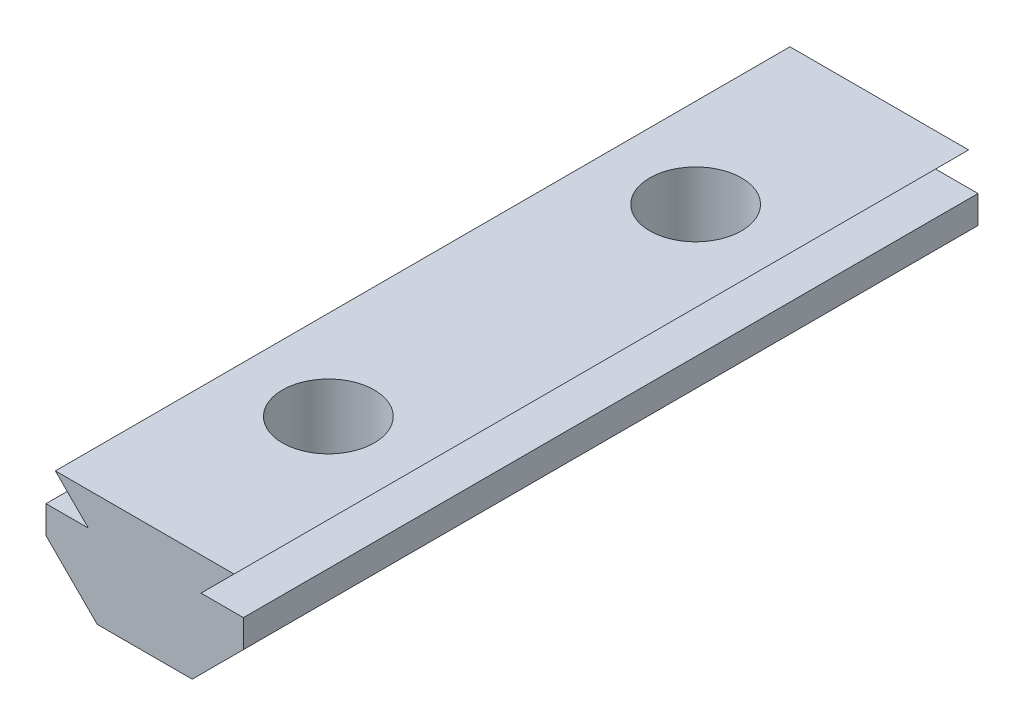
ISO-10303-21;
HEADER;
FILE_DESCRIPTION(('STEP AP214'),'2;1');
FILE_NAME('part.step','',(''),(''),'','','');
FILE_SCHEMA(('AUTOMOTIVE_DESIGN { 1 0 10303 214 1 1 1 1 }'));
ENDSEC;
DATA;
#1=APPLICATION_CONTEXT('core data for automotive mechanical design processes');
#2=APPLICATION_PROTOCOL_DEFINITION('international standard','automotive_design',2000,#1);
#3=PRODUCT_CONTEXT('',#1,'mechanical');
#4=PRODUCT('Part','Part','',(#3));
#5=PRODUCT_RELATED_PRODUCT_CATEGORY('part','',(#4));
#6=PRODUCT_DEFINITION_FORMATION('','',#4);
#7=PRODUCT_DEFINITION_CONTEXT('part definition',#1,'design');
#8=PRODUCT_DEFINITION('design','',#6,#7);
#9=PRODUCT_DEFINITION_SHAPE('','',#8);
#10=(LENGTH_UNIT() NAMED_UNIT(*) SI_UNIT(.MILLI.,.METRE.));
#11=(NAMED_UNIT(*) PLANE_ANGLE_UNIT() SI_UNIT($,.RADIAN.));
#12=(NAMED_UNIT(*) SI_UNIT($,.STERADIAN.) SOLID_ANGLE_UNIT());
#13=UNCERTAINTY_MEASURE_WITH_UNIT(LENGTH_MEASURE(1.E-05),#10,'distance_accuracy_value','');
#14=(GEOMETRIC_REPRESENTATION_CONTEXT(3) GLOBAL_UNCERTAINTY_ASSIGNED_CONTEXT((#13)) GLOBAL_UNIT_ASSIGNED_CONTEXT((#10,
#11,#12)) REPRESENTATION_CONTEXT('',''));
#15=CARTESIAN_POINT('',(0.,0.,0.));
#16=DIRECTION('',(0.,0.,1.));
#17=DIRECTION('',(1.,0.,0.));
#18=AXIS2_PLACEMENT_3D('',#15,#16,#17);
#19=CARTESIAN_POINT('',(2.58565352773282,0.,40.));
#20=DIRECTION('',(-0.707106781186543,0.707106781186552,0.));
#21=DIRECTION('',(-0.707106781186552,-0.707106781186543,0.));
#22=AXIS2_PLACEMENT_3D('',#19,#20,#21);
#23=PLANE('',#22);
#24=DIRECTION('',(0.707106781186552,0.707106781186543,0.));
#25=VECTOR('',#24,1.);
#26=CARTESIAN_POINT('',(2.58565352773282,0.,0.));
#27=LINE('',#26,#25);
#28=CARTESIAN_POINT('',(2.58565352773282,0.,0.));
#29=VERTEX_POINT('',#28);
#30=CARTESIAN_POINT('',(5.375,2.78934647226715,0.));
#31=VERTEX_POINT('',#30);
#32=EDGE_CURVE('E152',#29,#31,#27,.T.);
#33=ORIENTED_EDGE('',*,*,#32,.T.);
#34=DIRECTION('',(0.,0.,-1.));
#35=VECTOR('',#34,1.);
#36=CARTESIAN_POINT('',(5.375,2.78934647226715,40.));
#37=LINE('',#36,#35);
#38=CARTESIAN_POINT('',(5.375,2.78934647226715,40.));
#39=VERTEX_POINT('',#38);
#40=EDGE_CURVE('E11',#39,#31,#37,.T.);
#41=ORIENTED_EDGE('',*,*,#40,.F.);
#42=DIRECTION('',(0.707106781186552,0.707106781186543,0.));
#43=VECTOR('',#42,1.);
#44=CARTESIAN_POINT('',(2.58565352773282,0.,40.));
#45=LINE('',#44,#43);
#46=CARTESIAN_POINT('',(2.58565352773282,0.,40.));
#47=VERTEX_POINT('',#46);
#48=EDGE_CURVE('E181',#47,#39,#45,.T.);
#49=ORIENTED_EDGE('',*,*,#48,.F.);
#50=DIRECTION('',(0.,0.,-1.));
#51=VECTOR('',#50,1.);
#52=CARTESIAN_POINT('',(2.58565352773282,0.,40.));
#53=LINE('',#52,#51);
#54=EDGE_CURVE('E148',#47,#29,#53,.T.);
#55=ORIENTED_EDGE('',*,*,#54,.T.);
#56=EDGE_LOOP('',(#33,#41,#49,#55));
#57=FACE_BOUND('',#56,.T.);
#58=ADVANCED_FACE('F39',(#57),#23,.F.);
#59=CARTESIAN_POINT('',(5.375,2.78934647226715,40.));
#60=DIRECTION('',(-1.,0.,0.));
#61=DIRECTION('',(0.,0.,1.));
#62=AXIS2_PLACEMENT_3D('',#59,#60,#61);
#63=PLANE('',#62);
#64=DIRECTION('',(0.,1.,0.));
#65=VECTOR('',#64,1.);
#66=CARTESIAN_POINT('',(5.375,2.78934647226715,0.));
#67=LINE('',#66,#65);
#68=CARTESIAN_POINT('',(5.375,4.3,0.));
#69=VERTEX_POINT('',#68);
#70=EDGE_CURVE('E156',#31,#69,#67,.T.);
#71=ORIENTED_EDGE('',*,*,#70,.T.);
#72=DIRECTION('',(0.,0.,-1.));
#73=VECTOR('',#72,1.);
#74=CARTESIAN_POINT('',(5.375,4.3,40.));
#75=LINE('',#74,#73);
#76=CARTESIAN_POINT('',(5.375,4.3,40.));
#77=VERTEX_POINT('',#76);
#78=EDGE_CURVE('E48',#77,#69,#75,.T.);
#79=ORIENTED_EDGE('',*,*,#78,.F.);
#80=DIRECTION('',(0.,1.,0.));
#81=VECTOR('',#80,1.);
#82=CARTESIAN_POINT('',(5.375,2.78934647226715,40.));
#83=LINE('',#82,#81);
#84=EDGE_CURVE('E105',#39,#77,#83,.T.);
#85=ORIENTED_EDGE('',*,*,#84,.F.);
#86=ORIENTED_EDGE('',*,*,#40,.T.);
#87=EDGE_LOOP('',(#71,#79,#85,#86));
#88=FACE_BOUND('',#87,.T.);
#89=ADVANCED_FACE('F285',(#88),#63,.F.);
#90=CARTESIAN_POINT('',(5.375,4.3,40.));
#91=DIRECTION('',(0.,-1.,0.));
#92=DIRECTION('',(0.,0.,-1.));
#93=AXIS2_PLACEMENT_3D('',#90,#91,#92);
#94=PLANE('',#93);
#95=DIRECTION('',(-1.,0.,0.));
#96=VECTOR('',#95,1.);
#97=CARTESIAN_POINT('',(5.375,4.3,0.));
#98=LINE('',#97,#96);
#99=CARTESIAN_POINT('',(3.065,4.3,0.));
#100=VERTEX_POINT('',#99);
#101=EDGE_CURVE('E160',#69,#100,#98,.T.);
#102=ORIENTED_EDGE('',*,*,#101,.T.);
#103=DIRECTION('',(0.,0.,-1.));
#104=VECTOR('',#103,1.);
#105=CARTESIAN_POINT('',(3.065,4.3,40.));
#106=LINE('',#105,#104);
#107=CARTESIAN_POINT('',(3.065,4.3,40.));
#108=VERTEX_POINT('',#107);
#109=EDGE_CURVE('E200',#108,#100,#106,.T.);
#110=ORIENTED_EDGE('',*,*,#109,.F.);
#111=DIRECTION('',(-1.,0.,0.));
#112=VECTOR('',#111,1.);
#113=CARTESIAN_POINT('',(5.375,4.3,40.));
#114=LINE('',#113,#112);
#115=EDGE_CURVE('E210',#77,#108,#114,.T.);
#116=ORIENTED_EDGE('',*,*,#115,.F.);
#117=ORIENTED_EDGE('',*,*,#78,.T.);
#118=EDGE_LOOP('',(#102,#110,#116,#117));
#119=FACE_BOUND('',#118,.T.);
#120=ADVANCED_FACE('F208',(#119),#94,.F.);
#121=CARTESIAN_POINT('',(3.065,4.3,40.));
#122=DIRECTION('',(-0.707106781186545,0.70710678118655,0.));
#123=DIRECTION('',(-0.70710678118655,-0.707106781186545,0.));
#124=AXIS2_PLACEMENT_3D('',#121,#122,#123);
#125=PLANE('',#124);
#126=DIRECTION('',(0.70710678118655,0.707106781186545,0.));
#127=VECTOR('',#126,1.);
#128=CARTESIAN_POINT('',(3.065,4.3,0.));
#129=LINE('',#128,#127);
#130=CARTESIAN_POINT('',(4.86500000000002,6.1,0.));
#131=VERTEX_POINT('',#130);
#132=EDGE_CURVE('E163',#100,#131,#129,.T.);
#133=ORIENTED_EDGE('',*,*,#132,.T.);
#134=DIRECTION('',(0.,0.,-1.));
#135=VECTOR('',#134,1.);
#136=CARTESIAN_POINT('',(4.86500000000002,6.1,40.));
#137=LINE('',#136,#135);
#138=CARTESIAN_POINT('',(4.86500000000002,6.1,40.));
#139=VERTEX_POINT('',#138);
#140=EDGE_CURVE('E196',#139,#131,#137,.T.);
#141=ORIENTED_EDGE('',*,*,#140,.F.);
#142=DIRECTION('',(0.70710678118655,0.707106781186545,0.));
#143=VECTOR('',#142,1.);
#144=CARTESIAN_POINT('',(3.065,4.3,40.));
#145=LINE('',#144,#143);
#146=EDGE_CURVE('E229',#108,#139,#145,.T.);
#147=ORIENTED_EDGE('',*,*,#146,.F.);
#148=ORIENTED_EDGE('',*,*,#109,.T.);
#149=EDGE_LOOP('',(#133,#141,#147,#148));
#150=FACE_BOUND('',#149,.T.);
#151=ADVANCED_FACE('F219',(#150),#125,.F.);
#152=CARTESIAN_POINT('',(4.86500000000002,6.1,40.));
#153=DIRECTION('',(0.,-1.,0.));
#154=DIRECTION('',(1.,0.,0.));
#155=AXIS2_PLACEMENT_3D('',#152,#153,#154);
#156=PLANE('',#155);
#157=CARTESIAN_POINT('',(0.,6.1,30.));
#158=DIRECTION('',(0.,1.,0.));
#159=DIRECTION('',(-1.,0.,0.));
#160=AXIS2_PLACEMENT_3D('',#157,#158,#159);
#161=CIRCLE('',#160,2.5);
#162=CARTESIAN_POINT('',(-2.5,6.1,30.));
#163=VERTEX_POINT('',#162);
#164=EDGE_CURVE('E251',#163,#163,#161,.T.);
#165=ORIENTED_EDGE('',*,*,#164,.F.);
#166=EDGE_LOOP('',(#165));
#167=FACE_BOUND('',#166,.T.);
#168=CARTESIAN_POINT('',(0.,6.1,10.));
#169=DIRECTION('',(0.,1.,0.));
#170=DIRECTION('',(-1.,0.,0.));
#171=AXIS2_PLACEMENT_3D('',#168,#169,#170);
#172=CIRCLE('',#171,2.5);
#173=CARTESIAN_POINT('',(-2.5,6.1,10.));
#174=VERTEX_POINT('',#173);
#175=EDGE_CURVE('E243',#174,#174,#172,.T.);
#176=ORIENTED_EDGE('',*,*,#175,.F.);
#177=EDGE_LOOP('',(#176));
#178=FACE_BOUND('',#177,.T.);
#179=DIRECTION('',(-1.,0.,0.));
#180=VECTOR('',#179,1.);
#181=CARTESIAN_POINT('',(4.86500000000002,6.1,0.));
#182=LINE('',#181,#180);
#183=CARTESIAN_POINT('',(-4.86500000000002,6.1,0.));
#184=VERTEX_POINT('',#183);
#185=EDGE_CURVE('E166',#131,#184,#182,.T.);
#186=ORIENTED_EDGE('',*,*,#185,.T.);
#187=DIRECTION('',(0.,0.,-1.));
#188=VECTOR('',#187,1.);
#189=CARTESIAN_POINT('',(-4.86500000000002,6.1,40.));
#190=LINE('',#189,#188);
#191=CARTESIAN_POINT('',(-4.86500000000002,6.1,40.));
#192=VERTEX_POINT('',#191);
#193=EDGE_CURVE('E192',#192,#184,#190,.T.);
#194=ORIENTED_EDGE('',*,*,#193,.F.);
#195=DIRECTION('',(-1.,0.,0.));
#196=VECTOR('',#195,1.);
#197=CARTESIAN_POINT('',(4.86500000000002,6.1,40.));
#198=LINE('',#197,#196);
#199=EDGE_CURVE('E225',#139,#192,#198,.T.);
#200=ORIENTED_EDGE('',*,*,#199,.F.);
#201=ORIENTED_EDGE('',*,*,#140,.T.);
#202=EDGE_LOOP('',(#186,#194,#200,#201));
#203=FACE_BOUND('',#202,.T.);
#204=ADVANCED_FACE('F223',(#167,#178,#203),#156,.F.);
#205=CARTESIAN_POINT('',(-3.065,4.3,40.));
#206=DIRECTION('',(0.707106781186544,0.707106781186551,0.));
#207=DIRECTION('',(-0.707106781186551,0.707106781186544,0.));
#208=AXIS2_PLACEMENT_3D('',#205,#206,#207);
#209=PLANE('',#208);
#210=DIRECTION('',(0.707106781186551,-0.707106781186544,0.));
#211=VECTOR('',#210,1.);
#212=CARTESIAN_POINT('',(-3.065,4.3,0.));
#213=LINE('',#212,#211);
#214=CARTESIAN_POINT('',(-3.065,4.3,0.));
#215=VERTEX_POINT('',#214);
#216=EDGE_CURVE('E169',#184,#215,#213,.T.);
#217=ORIENTED_EDGE('',*,*,#216,.T.);
#218=DIRECTION('',(0.,0.,-1.));
#219=VECTOR('',#218,1.);
#220=CARTESIAN_POINT('',(-3.065,4.3,40.));
#221=LINE('',#220,#219);
#222=CARTESIAN_POINT('',(-3.065,4.3,40.));
#223=VERTEX_POINT('',#222);
#224=EDGE_CURVE('E188',#223,#215,#221,.T.);
#225=ORIENTED_EDGE('',*,*,#224,.F.);
#226=DIRECTION('',(0.707106781186551,-0.707106781186544,0.));
#227=VECTOR('',#226,1.);
#228=CARTESIAN_POINT('',(-3.065,4.3,40.));
#229=LINE('',#228,#227);
#230=EDGE_CURVE('E228',#192,#223,#229,.T.);
#231=ORIENTED_EDGE('',*,*,#230,.F.);
#232=ORIENTED_EDGE('',*,*,#193,.T.);
#233=EDGE_LOOP('',(#217,#225,#231,#232));
#234=FACE_BOUND('',#233,.T.);
#235=ADVANCED_FACE('F271',(#234),#209,.F.);
#236=CARTESIAN_POINT('',(-5.375,4.3,40.));
#237=DIRECTION('',(0.,-1.,0.));
#238=DIRECTION('',(1.,0.,0.));
#239=AXIS2_PLACEMENT_3D('',#236,#237,#238);
#240=PLANE('',#239);
#241=DIRECTION('',(-1.,0.,0.));
#242=VECTOR('',#241,1.);
#243=CARTESIAN_POINT('',(-5.375,4.3,0.));
#244=LINE('',#243,#242);
#245=CARTESIAN_POINT('',(-5.375,4.3,0.));
#246=VERTEX_POINT('',#245);
#247=EDGE_CURVE('E172',#215,#246,#244,.T.);
#248=ORIENTED_EDGE('',*,*,#247,.T.);
#249=DIRECTION('',(0.,0.,-1.));
#250=VECTOR('',#249,1.);
#251=CARTESIAN_POINT('',(-5.375,4.3,40.));
#252=LINE('',#251,#250);
#253=CARTESIAN_POINT('',(-5.375,4.3,40.));
#254=VERTEX_POINT('',#253);
#255=EDGE_CURVE('E141',#254,#246,#252,.T.);
#256=ORIENTED_EDGE('',*,*,#255,.F.);
#257=DIRECTION('',(-1.,0.,0.));
#258=VECTOR('',#257,1.);
#259=CARTESIAN_POINT('',(-5.375,4.3,40.));
#260=LINE('',#259,#258);
#261=EDGE_CURVE('E130',#223,#254,#260,.T.);
#262=ORIENTED_EDGE('',*,*,#261,.F.);
#263=ORIENTED_EDGE('',*,*,#224,.T.);
#264=EDGE_LOOP('',(#248,#256,#262,#263));
#265=FACE_BOUND('',#264,.T.);
#266=ADVANCED_FACE('F294',(#265),#240,.F.);
#267=CARTESIAN_POINT('',(-5.375,2.78934647226715,40.));
#268=DIRECTION('',(1.,0.,0.));
#269=DIRECTION('',(0.,0.,-1.));
#270=AXIS2_PLACEMENT_3D('',#267,#268,#269);
#271=PLANE('',#270);
#272=DIRECTION('',(0.,-1.,0.));
#273=VECTOR('',#272,1.);
#274=CARTESIAN_POINT('',(-5.375,2.78934647226715,0.));
#275=LINE('',#274,#273);
#276=CARTESIAN_POINT('',(-5.375,2.78934647226715,0.));
#277=VERTEX_POINT('',#276);
#278=EDGE_CURVE('E139',#246,#277,#275,.T.);
#279=ORIENTED_EDGE('',*,*,#278,.T.);
#280=DIRECTION('',(0.,0.,-1.));
#281=VECTOR('',#280,1.);
#282=CARTESIAN_POINT('',(-5.375,2.78934647226715,40.));
#283=LINE('',#282,#281);
#284=CARTESIAN_POINT('',(-5.375,2.78934647226715,40.));
#285=VERTEX_POINT('',#284);
#286=EDGE_CURVE('E136',#285,#277,#283,.T.);
#287=ORIENTED_EDGE('',*,*,#286,.F.);
#288=DIRECTION('',(0.,-1.,0.));
#289=VECTOR('',#288,1.);
#290=CARTESIAN_POINT('',(-5.375,2.78934647226715,40.));
#291=LINE('',#290,#289);
#292=EDGE_CURVE('E124',#254,#285,#291,.T.);
#293=ORIENTED_EDGE('',*,*,#292,.F.);
#294=ORIENTED_EDGE('',*,*,#255,.T.);
#295=EDGE_LOOP('',(#279,#287,#293,#294));
#296=FACE_BOUND('',#295,.T.);
#297=ADVANCED_FACE('F137',(#296),#271,.F.);
#298=CARTESIAN_POINT('',(-2.58565352773282,0.,40.));
#299=DIRECTION('',(0.707106781186544,0.707106781186551,0.));
#300=DIRECTION('',(-0.707106781186551,0.707106781186544,0.));
#301=AXIS2_PLACEMENT_3D('',#298,#299,#300);
#302=PLANE('',#301);
#303=DIRECTION('',(0.707106781186551,-0.707106781186544,0.));
#304=VECTOR('',#303,1.);
#305=CARTESIAN_POINT('',(-2.58565352773282,0.,0.));
#306=LINE('',#305,#304);
#307=CARTESIAN_POINT('',(-2.58565352773282,0.,0.));
#308=VERTEX_POINT('',#307);
#309=EDGE_CURVE('E91',#277,#308,#306,.T.);
#310=ORIENTED_EDGE('',*,*,#309,.T.);
#311=DIRECTION('',(0.,0.,-1.));
#312=VECTOR('',#311,1.);
#313=CARTESIAN_POINT('',(-2.58565352773282,0.,40.));
#314=LINE('',#313,#312);
#315=CARTESIAN_POINT('',(-2.58565352773282,0.,40.));
#316=VERTEX_POINT('',#315);
#317=EDGE_CURVE('E142',#316,#308,#314,.T.);
#318=ORIENTED_EDGE('',*,*,#317,.F.);
#319=DIRECTION('',(0.707106781186551,-0.707106781186544,0.));
#320=VECTOR('',#319,1.);
#321=CARTESIAN_POINT('',(-2.58565352773282,0.,40.));
#322=LINE('',#321,#320);
#323=EDGE_CURVE('E128',#285,#316,#322,.T.);
#324=ORIENTED_EDGE('',*,*,#323,.F.);
#325=ORIENTED_EDGE('',*,*,#286,.T.);
#326=EDGE_LOOP('',(#310,#318,#324,#325));
#327=FACE_BOUND('',#326,.T.);
#328=ADVANCED_FACE('F144',(#327),#302,.F.);
#329=CARTESIAN_POINT('',(-2.58565352773282,0.,40.));
#330=DIRECTION('',(0.,1.,0.));
#331=DIRECTION('',(-1.,0.,0.));
#332=AXIS2_PLACEMENT_3D('',#329,#330,#331);
#333=PLANE('',#332);
#334=CARTESIAN_POINT('',(0.,0.,30.));
#335=DIRECTION('',(0.,1.,0.));
#336=DIRECTION('',(-1.,0.,0.));
#337=AXIS2_PLACEMENT_3D('',#334,#335,#336);
#338=CIRCLE('',#337,2.5);
#339=CARTESIAN_POINT('',(-2.5,0.,30.));
#340=VERTEX_POINT('',#339);
#341=EDGE_CURVE('E157',#340,#340,#338,.T.);
#342=ORIENTED_EDGE('',*,*,#341,.T.);
#343=EDGE_LOOP('',(#342));
#344=FACE_BOUND('',#343,.T.);
#345=CARTESIAN_POINT('',(0.,0.,10.));
#346=DIRECTION('',(0.,1.,0.));
#347=DIRECTION('',(-1.,0.,0.));
#348=AXIS2_PLACEMENT_3D('',#345,#346,#347);
#349=CIRCLE('',#348,2.5);
#350=CARTESIAN_POINT('',(-2.5,0.,10.));
#351=VERTEX_POINT('',#350);
#352=EDGE_CURVE('E247',#351,#351,#349,.T.);
#353=ORIENTED_EDGE('',*,*,#352,.T.);
#354=EDGE_LOOP('',(#353));
#355=FACE_BOUND('',#354,.T.);
#356=DIRECTION('',(1.,0.,0.));
#357=VECTOR('',#356,1.);
#358=CARTESIAN_POINT('',(-2.58565352773282,0.,0.));
#359=LINE('',#358,#357);
#360=EDGE_CURVE('E97',#308,#29,#359,.T.);
#361=ORIENTED_EDGE('',*,*,#360,.T.);
#362=ORIENTED_EDGE('',*,*,#54,.F.);
#363=DIRECTION('',(1.,0.,0.));
#364=VECTOR('',#363,1.);
#365=CARTESIAN_POINT('',(-2.58565352773282,0.,40.));
#366=LINE('',#365,#364);
#367=EDGE_CURVE('E56',#316,#47,#366,.T.);
#368=ORIENTED_EDGE('',*,*,#367,.F.);
#369=ORIENTED_EDGE('',*,*,#317,.T.);
#370=EDGE_LOOP('',(#361,#362,#368,#369));
#371=FACE_BOUND('',#370,.T.);
#372=ADVANCED_FACE('F259',(#344,#355,#371),#333,.F.);
#373=CARTESIAN_POINT('',(0.,0.,40.));
#374=DIRECTION('',(0.,0.,1.));
#375=DIRECTION('',(1.,0.,0.));
#376=AXIS2_PLACEMENT_3D('',#373,#374,#375);
#377=PLANE('',#376);
#378=ORIENTED_EDGE('',*,*,#48,.T.);
#379=ORIENTED_EDGE('',*,*,#84,.T.);
#380=ORIENTED_EDGE('',*,*,#115,.T.);
#381=ORIENTED_EDGE('',*,*,#146,.T.);
#382=ORIENTED_EDGE('',*,*,#199,.T.);
#383=ORIENTED_EDGE('',*,*,#230,.T.);
#384=ORIENTED_EDGE('',*,*,#261,.T.);
#385=ORIENTED_EDGE('',*,*,#292,.T.);
#386=ORIENTED_EDGE('',*,*,#323,.T.);
#387=ORIENTED_EDGE('',*,*,#367,.T.);
#388=EDGE_LOOP('',(#378,#379,#380,#381,#382,#383,#384,#385,#386,#387));
#389=FACE_BOUND('',#388,.T.);
#390=ADVANCED_FACE('F126',(#389),#377,.T.);
#391=CARTESIAN_POINT('',(0.,0.,0.));
#392=DIRECTION('',(0.,0.,1.));
#393=DIRECTION('',(1.,0.,0.));
#394=AXIS2_PLACEMENT_3D('',#391,#392,#393);
#395=PLANE('',#394);
#396=ORIENTED_EDGE('',*,*,#32,.F.);
#397=ORIENTED_EDGE('',*,*,#360,.F.);
#398=ORIENTED_EDGE('',*,*,#309,.F.);
#399=ORIENTED_EDGE('',*,*,#278,.F.);
#400=ORIENTED_EDGE('',*,*,#247,.F.);
#401=ORIENTED_EDGE('',*,*,#216,.F.);
#402=ORIENTED_EDGE('',*,*,#185,.F.);
#403=ORIENTED_EDGE('',*,*,#132,.F.);
#404=ORIENTED_EDGE('',*,*,#101,.F.);
#405=ORIENTED_EDGE('',*,*,#70,.F.);
#406=EDGE_LOOP('',(#396,#397,#398,#399,#400,#401,#402,#403,#404,#405));
#407=FACE_BOUND('',#406,.T.);
#408=ADVANCED_FACE('F214',(#407),#395,.F.);
#409=CARTESIAN_POINT('',(0.,0.,10.));
#410=DIRECTION('',(0.,1.,0.));
#411=DIRECTION('',(-1.,0.,0.));
#412=AXIS2_PLACEMENT_3D('',#409,#410,#411);
#413=CYLINDRICAL_SURFACE('',#412,2.5);
#414=ORIENTED_EDGE('',*,*,#352,.F.);
#415=EDGE_LOOP('',(#414));
#416=FACE_BOUND('',#415,.T.);
#417=ORIENTED_EDGE('',*,*,#175,.T.);
#418=EDGE_LOOP('',(#417));
#419=FACE_BOUND('',#418,.T.);
#420=ADVANCED_FACE('F265',(#416,#419),#413,.F.);
#421=CARTESIAN_POINT('',(0.,0.,30.));
#422=DIRECTION('',(0.,1.,0.));
#423=DIRECTION('',(-1.,0.,0.));
#424=AXIS2_PLACEMENT_3D('',#421,#422,#423);
#425=CYLINDRICAL_SURFACE('',#424,2.5);
#426=ORIENTED_EDGE('',*,*,#341,.F.);
#427=EDGE_LOOP('',(#426));
#428=FACE_BOUND('',#427,.T.);
#429=ORIENTED_EDGE('',*,*,#164,.T.);
#430=EDGE_LOOP('',(#429));
#431=FACE_BOUND('',#430,.T.);
#432=ADVANCED_FACE('F262',(#428,#431),#425,.F.);
#433=CLOSED_SHELL('',(#58,#89,#120,#151,#204,#235,#266,#297,#328,#372,#390,#408,#420,#432));
#434=MANIFOLD_SOLID_BREP('B2',#433);
#435=ADVANCED_BREP_SHAPE_REPRESENTATION('',(#18,#434),#14);
#436=SHAPE_DEFINITION_REPRESENTATION(#9,#435);
ENDSEC;
END-ISO-10303-21;
